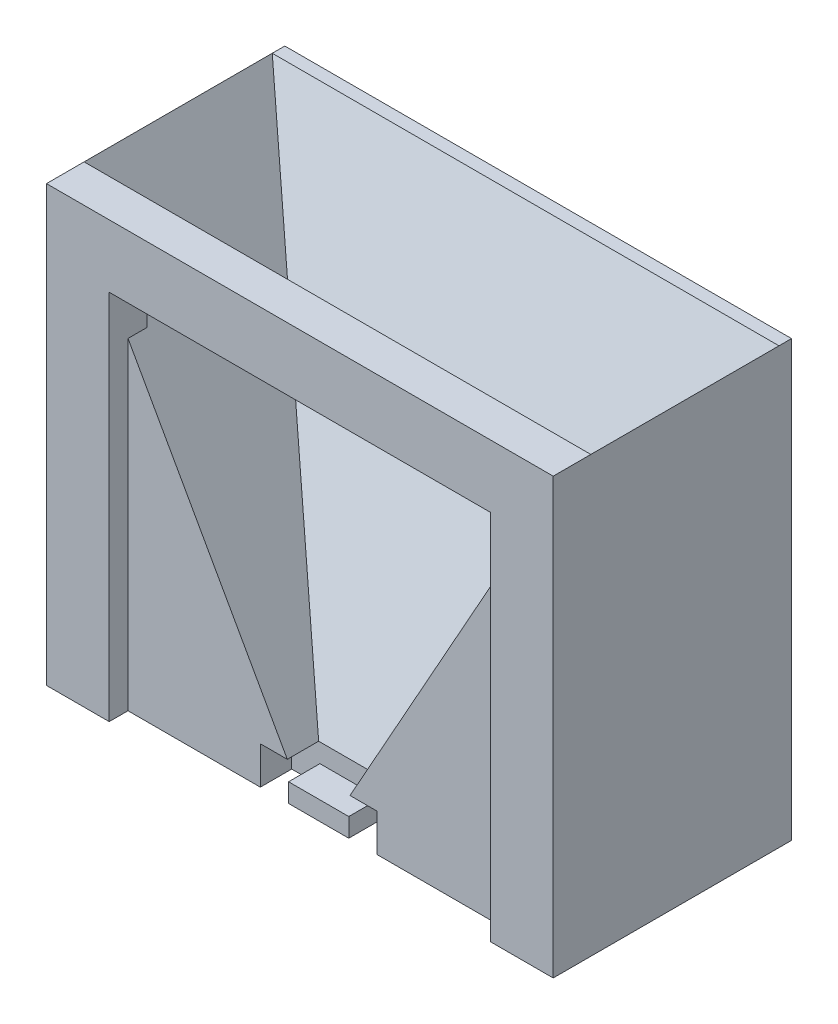
ISO-10303-21;
HEADER;
FILE_DESCRIPTION(('STEP AP214'),'2;1');
FILE_NAME('part.step','',(''),(''),'','','');
FILE_SCHEMA(('AUTOMOTIVE_DESIGN { 1 0 10303 214 1 1 1 1 }'));
ENDSEC;
DATA;
#1=APPLICATION_CONTEXT('core data for automotive mechanical design processes');
#2=APPLICATION_PROTOCOL_DEFINITION('international standard','automotive_design',2000,#1);
#3=PRODUCT_CONTEXT('',#1,'mechanical');
#4=PRODUCT('Part','Part','',(#3));
#5=PRODUCT_RELATED_PRODUCT_CATEGORY('part','',(#4));
#6=PRODUCT_DEFINITION_FORMATION('','',#4);
#7=PRODUCT_DEFINITION_CONTEXT('part definition',#1,'design');
#8=PRODUCT_DEFINITION('design','',#6,#7);
#9=PRODUCT_DEFINITION_SHAPE('','',#8);
#10=(LENGTH_UNIT() NAMED_UNIT(*) SI_UNIT(.MILLI.,.METRE.));
#11=(NAMED_UNIT(*) PLANE_ANGLE_UNIT() SI_UNIT($,.RADIAN.));
#12=(NAMED_UNIT(*) SI_UNIT($,.STERADIAN.) SOLID_ANGLE_UNIT());
#13=UNCERTAINTY_MEASURE_WITH_UNIT(LENGTH_MEASURE(1.E-05),#10,'distance_accuracy_value','');
#14=(GEOMETRIC_REPRESENTATION_CONTEXT(3) GLOBAL_UNCERTAINTY_ASSIGNED_CONTEXT((#13)) GLOBAL_UNIT_ASSIGNED_CONTEXT((#10,
#11,#12)) REPRESENTATION_CONTEXT('',''));
#15=CARTESIAN_POINT('',(0.,0.,0.));
#16=DIRECTION('',(0.,0.,1.));
#17=DIRECTION('',(1.,0.,0.));
#18=AXIS2_PLACEMENT_3D('',#15,#16,#17);
#19=CARTESIAN_POINT('',(0.,0.,0.));
#20=DIRECTION('',(0.,0.,-1.));
#21=DIRECTION('',(-1.,0.,0.));
#22=AXIS2_PLACEMENT_3D('',#19,#20,#21);
#23=PLANE('',#22);
#24=DIRECTION('',(-1.,0.,0.));
#25=VECTOR('',#24,1.);
#26=CARTESIAN_POINT('',(-5.,-24.9,0.));
#27=LINE('',#26,#25);
#28=CARTESIAN_POINT('',(4.8,-24.9,0.));
#29=VERTEX_POINT('',#28);
#30=CARTESIAN_POINT('',(-4.8,-24.9,0.));
#31=VERTEX_POINT('',#30);
#32=EDGE_CURVE('E182',#29,#31,#27,.T.);
#33=ORIENTED_EDGE('',*,*,#32,.T.);
#34=DIRECTION('',(0.,1.,0.));
#35=VECTOR('',#34,1.);
#36=CARTESIAN_POINT('',(-4.8,-21.9,0.));
#37=LINE('',#36,#35);
#38=CARTESIAN_POINT('',(-4.8,-27.9,0.));
#39=VERTEX_POINT('',#38);
#40=EDGE_CURVE('E233',#39,#31,#37,.T.);
#41=ORIENTED_EDGE('',*,*,#40,.F.);
#42=DIRECTION('',(1.,0.,0.));
#43=VECTOR('',#42,1.);
#44=CARTESIAN_POINT('',(40.4,-27.9,0.));
#45=LINE('',#44,#43);
#46=CARTESIAN_POINT('',(4.8,-27.9,0.));
#47=VERTEX_POINT('',#46);
#48=EDGE_CURVE('E202',#39,#47,#45,.T.);
#49=ORIENTED_EDGE('',*,*,#48,.T.);
#50=DIRECTION('',(0.,-1.,0.));
#51=VECTOR('',#50,1.);
#52=CARTESIAN_POINT('',(4.8,-21.9,0.));
#53=LINE('',#52,#51);
#54=EDGE_CURVE('E195',#29,#47,#53,.T.);
#55=ORIENTED_EDGE('',*,*,#54,.F.);
#56=EDGE_LOOP('',(#33,#41,#49,#55));
#57=FACE_BOUND('',#56,.T.);
#58=ADVANCED_FACE('F33',(#57),#23,.F.);
#59=CARTESIAN_POINT('',(-4.8,-21.9,-5.));
#60=DIRECTION('',(1.,0.,0.));
#61=DIRECTION('',(0.,1.,0.));
#62=AXIS2_PLACEMENT_3D('',#59,#60,#61);
#63=PLANE('',#62);
#64=DIRECTION('',(0.,0.,1.));
#65=VECTOR('',#64,1.);
#66=CARTESIAN_POINT('',(-4.8,-24.9,-5.));
#67=LINE('',#66,#65);
#68=CARTESIAN_POINT('',(-4.8,-24.9,-5.));
#69=VERTEX_POINT('',#68);
#70=EDGE_CURVE('E185',#69,#31,#67,.T.);
#71=ORIENTED_EDGE('',*,*,#70,.F.);
#72=DIRECTION('',(0.,1.,0.));
#73=VECTOR('',#72,1.);
#74=CARTESIAN_POINT('',(-4.8,-21.9,-5.));
#75=LINE('',#74,#73);
#76=CARTESIAN_POINT('',(-4.8,-27.9,-5.));
#77=VERTEX_POINT('',#76);
#78=EDGE_CURVE('E223',#77,#69,#75,.T.);
#79=ORIENTED_EDGE('',*,*,#78,.F.);
#80=DIRECTION('',(0.,0.,1.));
#81=VECTOR('',#80,1.);
#82=CARTESIAN_POINT('',(-4.8,-27.9,-5.));
#83=LINE('',#82,#81);
#84=EDGE_CURVE('E232',#77,#39,#83,.T.);
#85=ORIENTED_EDGE('',*,*,#84,.T.);
#86=ORIENTED_EDGE('',*,*,#40,.T.);
#87=EDGE_LOOP('',(#71,#79,#85,#86));
#88=FACE_BOUND('',#87,.T.);
#89=ADVANCED_FACE('F371',(#88),#63,.F.);
#90=CARTESIAN_POINT('',(4.8,-21.9,-5.));
#91=DIRECTION('',(-1.,0.,0.));
#92=DIRECTION('',(0.,-1.,0.));
#93=AXIS2_PLACEMENT_3D('',#90,#91,#92);
#94=PLANE('',#93);
#95=DIRECTION('',(0.,0.,-1.));
#96=VECTOR('',#95,1.);
#97=CARTESIAN_POINT('',(4.8,-24.9,10.2489023802552));
#98=LINE('',#97,#96);
#99=CARTESIAN_POINT('',(4.8,-24.9,-5.));
#100=VERTEX_POINT('',#99);
#101=EDGE_CURVE('E50',#29,#100,#98,.T.);
#102=ORIENTED_EDGE('',*,*,#101,.F.);
#103=ORIENTED_EDGE('',*,*,#54,.T.);
#104=DIRECTION('',(0.,0.,1.));
#105=VECTOR('',#104,1.);
#106=CARTESIAN_POINT('',(4.8,-27.9,-5.));
#107=LINE('',#106,#105);
#108=CARTESIAN_POINT('',(4.8,-27.9,-5.));
#109=VERTEX_POINT('',#108);
#110=EDGE_CURVE('E213',#109,#47,#107,.T.);
#111=ORIENTED_EDGE('',*,*,#110,.F.);
#112=DIRECTION('',(0.,-1.,0.));
#113=VECTOR('',#112,1.);
#114=CARTESIAN_POINT('',(4.8,-21.9,-5.));
#115=LINE('',#114,#113);
#116=EDGE_CURVE('E197',#100,#109,#115,.T.);
#117=ORIENTED_EDGE('',*,*,#116,.F.);
#118=EDGE_LOOP('',(#102,#103,#111,#117));
#119=FACE_BOUND('',#118,.T.);
#120=ADVANCED_FACE('F193',(#119),#94,.F.);
#121=CARTESIAN_POINT('',(-30.4,-27.9,0.));
#122=VERTEX_POINT('',#121);
#123=CARTESIAN_POINT('',(-9.3,-27.9,0.));
#124=VERTEX_POINT('',#123);
#125=EDGE_CURVE('E301',#122,#124,#45,.T.);
#126=ORIENTED_EDGE('',*,*,#125,.T.);
#127=DIRECTION('',(0.,-1.,0.));
#128=VECTOR('',#127,1.);
#129=CARTESIAN_POINT('',(-9.3,-27.9,0.));
#130=LINE('',#129,#128);
#131=CARTESIAN_POINT('',(-9.3,-21.9,0.));
#132=VERTEX_POINT('',#131);
#133=EDGE_CURVE('E224',#132,#124,#130,.T.);
#134=ORIENTED_EDGE('',*,*,#133,.F.);
#135=DIRECTION('',(-1.,0.,0.));
#136=VECTOR('',#135,1.);
#137=CARTESIAN_POINT('',(-9.3,-21.9,0.));
#138=LINE('',#137,#136);
#139=CARTESIAN_POINT('',(-5.,-21.9,0.));
#140=VERTEX_POINT('',#139);
#141=EDGE_CURVE('E235',#140,#132,#138,.T.);
#142=ORIENTED_EDGE('',*,*,#141,.F.);
#143=DIRECTION('',(-0.488099458469831,0.872788014721477,0.));
#144=VECTOR('',#143,1.);
#145=CARTESIAN_POINT('',(-40.4,41.4,0.));
#146=LINE('',#145,#144);
#147=CARTESIAN_POINT('',(-30.4,23.5186440677966,0.));
#148=VERTEX_POINT('',#147);
#149=EDGE_CURVE('E287',#140,#148,#146,.T.);
#150=ORIENTED_EDGE('',*,*,#149,.T.);
#151=DIRECTION('',(0.,1.,0.));
#152=VECTOR('',#151,1.);
#153=CARTESIAN_POINT('',(-30.4,31.4,0.));
#154=LINE('',#153,#152);
#155=EDGE_CURVE('E254',#122,#148,#154,.T.);
#156=ORIENTED_EDGE('',*,*,#155,.F.);
#157=EDGE_LOOP('',(#126,#134,#142,#150,#156));
#158=FACE_BOUND('',#157,.T.);
#159=ADVANCED_FACE('F373',(#158),#23,.F.);
#160=CARTESIAN_POINT('',(40.4,41.4,-35.));
#161=DIRECTION('',(-0.872788014721477,0.488099458469831,0.));
#162=DIRECTION('',(-0.488099458469831,-0.872788014721477,0.));
#163=AXIS2_PLACEMENT_3D('',#160,#161,#162);
#164=PLANE('',#163);
#165=DIRECTION('',(0.455343601054797,0.814216100191205,-0.36015878049532));
#166=VECTOR('',#165,1.);
#167=CARTESIAN_POINT('',(40.7279919921245,41.986494155409,-33.2594286943358));
#168=LINE('',#167,#166);
#169=CARTESIAN_POINT('',(4.99999999999999,-21.9,-5.));
#170=VERTEX_POINT('',#169);
#171=CARTESIAN_POINT('',(40.4,41.4,-33.));
#172=VERTEX_POINT('',#171);
#173=EDGE_CURVE('E58',#170,#172,#168,.T.);
#174=ORIENTED_EDGE('',*,*,#173,.F.);
#175=DIRECTION('',(0.,0.,1.));
#176=VECTOR('',#175,1.);
#177=CARTESIAN_POINT('',(5.,-21.9,-35.));
#178=LINE('',#177,#176);
#179=CARTESIAN_POINT('',(5.,-21.9,0.));
#180=VERTEX_POINT('',#179);
#181=EDGE_CURVE('E306',#170,#180,#178,.T.);
#182=ORIENTED_EDGE('',*,*,#181,.T.);
#183=DIRECTION('',(-0.488099458469831,-0.872788014721477,0.));
#184=VECTOR('',#183,1.);
#185=CARTESIAN_POINT('',(40.4,41.4,0.));
#186=LINE('',#185,#184);
#187=CARTESIAN_POINT('',(30.4,23.5186440677966,0.));
#188=VERTEX_POINT('',#187);
#189=EDGE_CURVE('E292',#188,#180,#186,.T.);
#190=ORIENTED_EDGE('',*,*,#189,.F.);
#191=DIRECTION('',(0.,0.,-1.));
#192=VECTOR('',#191,1.);
#193=CARTESIAN_POINT('',(30.4,23.5186440677966,-3.));
#194=LINE('',#193,#192);
#195=CARTESIAN_POINT('',(30.4,23.5186440677966,-3.));
#196=VERTEX_POINT('',#195);
#197=EDGE_CURVE('E330',#188,#196,#194,.T.);
#198=ORIENTED_EDGE('',*,*,#197,.T.);
#199=DIRECTION('',(0.488099458469831,0.872788014721477,0.));
#200=VECTOR('',#199,1.);
#201=CARTESIAN_POINT('',(13.1383557190521,-7.34751646847463,-3.));
#202=LINE('',#201,#200);
#203=CARTESIAN_POINT('',(40.4,41.4,-3.));
#204=VERTEX_POINT('',#203);
#205=EDGE_CURVE('E327',#196,#204,#202,.T.);
#206=ORIENTED_EDGE('',*,*,#205,.T.);
#207=DIRECTION('',(0.,0.,1.));
#208=VECTOR('',#207,1.);
#209=CARTESIAN_POINT('',(40.4,41.4,-35.));
#210=LINE('',#209,#208);
#211=EDGE_CURVE('E313',#172,#204,#210,.T.);
#212=ORIENTED_EDGE('',*,*,#211,.F.);
#213=EDGE_LOOP('',(#174,#182,#190,#198,#206,#212));
#214=FACE_BOUND('',#213,.T.);
#215=ADVANCED_FACE('F383',(#214),#164,.T.);
#216=CARTESIAN_POINT('',(-40.4,41.4,-35.));
#217=DIRECTION('',(0.872788014721477,0.488099458469831,0.));
#218=DIRECTION('',(-0.488099458469831,0.872788014721477,0.));
#219=AXIS2_PLACEMENT_3D('',#216,#217,#218);
#220=PLANE('',#219);
#221=DIRECTION('',(0.455343601054797,-0.814216100191205,0.36015878049532));
#222=VECTOR('',#221,1.);
#223=CARTESIAN_POINT('',(-40.7279919921245,41.986494155409,-33.2594286943358));
#224=LINE('',#223,#222);
#225=CARTESIAN_POINT('',(-40.4,41.4,-33.));
#226=VERTEX_POINT('',#225);
#227=CARTESIAN_POINT('',(-4.99999999999999,-21.9,-5.));
#228=VERTEX_POINT('',#227);
#229=EDGE_CURVE('E246',#226,#228,#224,.T.);
#230=ORIENTED_EDGE('',*,*,#229,.F.);
#231=DIRECTION('',(0.,0.,1.));
#232=VECTOR('',#231,1.);
#233=CARTESIAN_POINT('',(-40.4,41.4,-35.));
#234=LINE('',#233,#232);
#235=CARTESIAN_POINT('',(-40.4,41.4,-3.));
#236=VERTEX_POINT('',#235);
#237=EDGE_CURVE('E321',#226,#236,#234,.T.);
#238=ORIENTED_EDGE('',*,*,#237,.T.);
#239=DIRECTION('',(0.488099458469831,-0.872788014721477,0.));
#240=VECTOR('',#239,1.);
#241=CARTESIAN_POINT('',(-13.1383557190521,-7.34751646847463,-3.));
#242=LINE('',#241,#240);
#243=CARTESIAN_POINT('',(-30.4,23.5186440677966,-3.));
#244=VERTEX_POINT('',#243);
#245=EDGE_CURVE('E309',#236,#244,#242,.T.);
#246=ORIENTED_EDGE('',*,*,#245,.T.);
#247=DIRECTION('',(0.,0.,1.));
#248=VECTOR('',#247,1.);
#249=CARTESIAN_POINT('',(-30.4,23.5186440677966,-3.));
#250=LINE('',#249,#248);
#251=EDGE_CURVE('E325',#244,#148,#250,.T.);
#252=ORIENTED_EDGE('',*,*,#251,.T.);
#253=ORIENTED_EDGE('',*,*,#149,.F.);
#254=DIRECTION('',(0.,0.,1.));
#255=VECTOR('',#254,1.);
#256=CARTESIAN_POINT('',(-5.,-21.9,-35.));
#257=LINE('',#256,#255);
#258=EDGE_CURVE('E297',#228,#140,#257,.T.);
#259=ORIENTED_EDGE('',*,*,#258,.F.);
#260=EDGE_LOOP('',(#230,#238,#246,#252,#253,#259));
#261=FACE_BOUND('',#260,.T.);
#262=ADVANCED_FACE('F386',(#261),#220,.T.);
#263=ORIENTED_EDGE('',*,*,#189,.T.);
#264=DIRECTION('',(-1.,0.,0.));
#265=VECTOR('',#264,1.);
#266=CARTESIAN_POINT('',(9.3,-21.9,0.));
#267=LINE('',#266,#265);
#268=CARTESIAN_POINT('',(9.3,-21.9,0.));
#269=VERTEX_POINT('',#268);
#270=EDGE_CURVE('E204',#269,#180,#267,.T.);
#271=ORIENTED_EDGE('',*,*,#270,.F.);
#272=DIRECTION('',(0.,1.,0.));
#273=VECTOR('',#272,1.);
#274=CARTESIAN_POINT('',(9.3,-27.9,0.));
#275=LINE('',#274,#273);
#276=CARTESIAN_POINT('',(9.3,-27.9,0.));
#277=VERTEX_POINT('',#276);
#278=EDGE_CURVE('E209',#277,#269,#275,.T.);
#279=ORIENTED_EDGE('',*,*,#278,.F.);
#280=CARTESIAN_POINT('',(30.4,-27.9,0.));
#281=VERTEX_POINT('',#280);
#282=EDGE_CURVE('E300',#277,#281,#45,.T.);
#283=ORIENTED_EDGE('',*,*,#282,.T.);
#284=DIRECTION('',(0.,-1.,0.));
#285=VECTOR('',#284,1.);
#286=CARTESIAN_POINT('',(30.4,31.4,0.));
#287=LINE('',#286,#285);
#288=EDGE_CURVE('E11',#188,#281,#287,.T.);
#289=ORIENTED_EDGE('',*,*,#288,.F.);
#290=EDGE_LOOP('',(#263,#271,#279,#283,#289));
#291=FACE_BOUND('',#290,.T.);
#292=ADVANCED_FACE('F374',(#291),#23,.F.);
#293=CARTESIAN_POINT('',(30.4,-26.4,-3.));
#294=DIRECTION('',(-1.,0.,0.));
#295=DIRECTION('',(0.,0.,1.));
#296=AXIS2_PLACEMENT_3D('',#293,#294,#295);
#297=PLANE('',#296);
#298=ORIENTED_EDGE('',*,*,#197,.F.);
#299=ORIENTED_EDGE('',*,*,#288,.T.);
#300=DIRECTION('',(0.,0.,-1.));
#301=VECTOR('',#300,1.);
#302=CARTESIAN_POINT('',(30.4,-27.9,3.));
#303=LINE('',#302,#301);
#304=CARTESIAN_POINT('',(30.4,-27.9,3.));
#305=VERTEX_POINT('',#304);
#306=EDGE_CURVE('E279',#305,#281,#303,.T.);
#307=ORIENTED_EDGE('',*,*,#306,.F.);
#308=DIRECTION('',(0.,-1.,0.));
#309=VECTOR('',#308,1.);
#310=CARTESIAN_POINT('',(30.4,31.4,3.));
#311=LINE('',#310,#309);
#312=CARTESIAN_POINT('',(30.4,31.4,3.));
#313=VERTEX_POINT('',#312);
#314=EDGE_CURVE('E268',#313,#305,#311,.T.);
#315=ORIENTED_EDGE('',*,*,#314,.F.);
#316=DIRECTION('',(0.,0.,1.));
#317=VECTOR('',#316,1.);
#318=CARTESIAN_POINT('',(30.4,31.4,-3.));
#319=LINE('',#318,#317);
#320=CARTESIAN_POINT('',(30.4,31.4,-3.));
#321=VERTEX_POINT('',#320);
#322=EDGE_CURVE('E42',#321,#313,#319,.T.);
#323=ORIENTED_EDGE('',*,*,#322,.F.);
#324=DIRECTION('',(0.,-1.,0.));
#325=VECTOR('',#324,1.);
#326=CARTESIAN_POINT('',(30.4,-26.4,-3.));
#327=LINE('',#326,#325);
#328=EDGE_CURVE('E332',#321,#196,#327,.T.);
#329=ORIENTED_EDGE('',*,*,#328,.T.);
#330=EDGE_LOOP('',(#298,#299,#307,#315,#323,#329));
#331=FACE_BOUND('',#330,.T.);
#332=ADVANCED_FACE('F35',(#331),#297,.T.);
#333=CARTESIAN_POINT('',(-30.4,31.4,-3.));
#334=DIRECTION('',(0.,-1.,0.));
#335=DIRECTION('',(0.,0.,-1.));
#336=AXIS2_PLACEMENT_3D('',#333,#334,#335);
#337=PLANE('',#336);
#338=ORIENTED_EDGE('',*,*,#322,.T.);
#339=DIRECTION('',(1.,0.,0.));
#340=VECTOR('',#339,1.);
#341=CARTESIAN_POINT('',(30.4,31.4,3.));
#342=LINE('',#341,#340);
#343=CARTESIAN_POINT('',(-30.4,31.4,3.));
#344=VERTEX_POINT('',#343);
#345=EDGE_CURVE('E265',#344,#313,#342,.T.);
#346=ORIENTED_EDGE('',*,*,#345,.F.);
#347=DIRECTION('',(0.,0.,1.));
#348=VECTOR('',#347,1.);
#349=CARTESIAN_POINT('',(-30.4,31.4,-3.));
#350=LINE('',#349,#348);
#351=CARTESIAN_POINT('',(-30.4,31.4,-3.));
#352=VERTEX_POINT('',#351);
#353=EDGE_CURVE('E344',#352,#344,#350,.T.);
#354=ORIENTED_EDGE('',*,*,#353,.F.);
#355=DIRECTION('',(1.,0.,0.));
#356=VECTOR('',#355,1.);
#357=CARTESIAN_POINT('',(-30.4,31.4,-3.));
#358=LINE('',#357,#356);
#359=EDGE_CURVE('E340',#352,#321,#358,.T.);
#360=ORIENTED_EDGE('',*,*,#359,.T.);
#361=EDGE_LOOP('',(#338,#346,#354,#360));
#362=FACE_BOUND('',#361,.T.);
#363=ADVANCED_FACE('F392',(#362),#337,.T.);
#364=CARTESIAN_POINT('',(-30.4,-26.4,-3.));
#365=DIRECTION('',(1.,0.,0.));
#366=DIRECTION('',(0.,0.,-1.));
#367=AXIS2_PLACEMENT_3D('',#364,#365,#366);
#368=PLANE('',#367);
#369=ORIENTED_EDGE('',*,*,#251,.F.);
#370=DIRECTION('',(0.,1.,0.));
#371=VECTOR('',#370,1.);
#372=CARTESIAN_POINT('',(-30.4,-26.4,-3.));
#373=LINE('',#372,#371);
#374=EDGE_CURVE('E338',#244,#352,#373,.T.);
#375=ORIENTED_EDGE('',*,*,#374,.T.);
#376=ORIENTED_EDGE('',*,*,#353,.T.);
#377=DIRECTION('',(0.,1.,0.));
#378=VECTOR('',#377,1.);
#379=CARTESIAN_POINT('',(-30.4,31.4,3.));
#380=LINE('',#379,#378);
#381=CARTESIAN_POINT('',(-30.4,-27.9,3.));
#382=VERTEX_POINT('',#381);
#383=EDGE_CURVE('E262',#382,#344,#380,.T.);
#384=ORIENTED_EDGE('',*,*,#383,.F.);
#385=DIRECTION('',(0.,0.,-1.));
#386=VECTOR('',#385,1.);
#387=CARTESIAN_POINT('',(-30.4,-27.9,3.));
#388=LINE('',#387,#386);
#389=EDGE_CURVE('E284',#382,#122,#388,.T.);
#390=ORIENTED_EDGE('',*,*,#389,.T.);
#391=ORIENTED_EDGE('',*,*,#155,.T.);
#392=EDGE_LOOP('',(#369,#375,#376,#384,#390,#391));
#393=FACE_BOUND('',#392,.T.);
#394=ADVANCED_FACE('F367',(#393),#368,.T.);
#395=CARTESIAN_POINT('',(-40.4,-26.4,-3.));
#396=DIRECTION('',(-1.,0.,0.));
#397=DIRECTION('',(0.,0.,1.));
#398=AXIS2_PLACEMENT_3D('',#395,#396,#397);
#399=PLANE('',#398);
#400=ORIENTED_EDGE('',*,*,#237,.F.);
#401=CARTESIAN_POINT('',(-40.4,41.4,-35.));
#402=VERTEX_POINT('',#401);
#403=EDGE_CURVE('E318',#402,#226,#234,.T.);
#404=ORIENTED_EDGE('',*,*,#403,.F.);
#405=DIRECTION('',(0.,-1.,0.));
#406=VECTOR('',#405,1.);
#407=CARTESIAN_POINT('',(-40.4,-27.9,-35.));
#408=LINE('',#407,#406);
#409=CARTESIAN_POINT('',(-40.4,-27.9,-35.));
#410=VERTEX_POINT('',#409);
#411=EDGE_CURVE('E288',#402,#410,#408,.T.);
#412=ORIENTED_EDGE('',*,*,#411,.T.);
#413=DIRECTION('',(0.,0.,1.));
#414=VECTOR('',#413,1.);
#415=CARTESIAN_POINT('',(-40.4,-27.9,-35.));
#416=LINE('',#415,#414);
#417=CARTESIAN_POINT('',(-40.4,-27.9,3.));
#418=VERTEX_POINT('',#417);
#419=EDGE_CURVE('E316',#410,#418,#416,.T.);
#420=ORIENTED_EDGE('',*,*,#419,.T.);
#421=DIRECTION('',(0.,-1.,0.));
#422=VECTOR('',#421,1.);
#423=CARTESIAN_POINT('',(-40.4,41.4,3.));
#424=LINE('',#423,#422);
#425=CARTESIAN_POINT('',(-40.4,41.4,3.));
#426=VERTEX_POINT('',#425);
#427=EDGE_CURVE('E257',#426,#418,#424,.T.);
#428=ORIENTED_EDGE('',*,*,#427,.F.);
#429=DIRECTION('',(0.,0.,1.));
#430=VECTOR('',#429,1.);
#431=CARTESIAN_POINT('',(-40.4,41.4,-3.));
#432=LINE('',#431,#430);
#433=EDGE_CURVE('E345',#236,#426,#432,.T.);
#434=ORIENTED_EDGE('',*,*,#433,.F.);
#435=EDGE_LOOP('',(#400,#404,#412,#420,#428,#434));
#436=FACE_BOUND('',#435,.T.);
#437=ADVANCED_FACE('F360',(#436),#399,.T.);
#438=CARTESIAN_POINT('',(-40.4,41.4,-3.));
#439=DIRECTION('',(0.,1.,0.));
#440=DIRECTION('',(0.,0.,1.));
#441=AXIS2_PLACEMENT_3D('',#438,#439,#440);
#442=PLANE('',#441);
#443=ORIENTED_EDGE('',*,*,#433,.T.);
#444=DIRECTION('',(-1.,0.,0.));
#445=VECTOR('',#444,1.);
#446=CARTESIAN_POINT('',(-40.4,41.4,3.));
#447=LINE('',#446,#445);
#448=CARTESIAN_POINT('',(40.4,41.4,3.));
#449=VERTEX_POINT('',#448);
#450=EDGE_CURVE('E276',#449,#426,#447,.T.);
#451=ORIENTED_EDGE('',*,*,#450,.F.);
#452=DIRECTION('',(0.,0.,1.));
#453=VECTOR('',#452,1.);
#454=CARTESIAN_POINT('',(40.4,41.4,-3.));
#455=LINE('',#454,#453);
#456=EDGE_CURVE('E37',#204,#449,#455,.T.);
#457=ORIENTED_EDGE('',*,*,#456,.F.);
#458=DIRECTION('',(-1.,0.,0.));
#459=VECTOR('',#458,1.);
#460=CARTESIAN_POINT('',(-40.4,41.4,-3.));
#461=LINE('',#460,#459);
#462=EDGE_CURVE('E335',#204,#236,#461,.T.);
#463=ORIENTED_EDGE('',*,*,#462,.T.);
#464=EDGE_LOOP('',(#443,#451,#457,#463));
#465=FACE_BOUND('',#464,.T.);
#466=ADVANCED_FACE('F358',(#465),#442,.T.);
#467=CARTESIAN_POINT('',(40.4,-26.4,-3.));
#468=DIRECTION('',(1.,0.,0.));
#469=DIRECTION('',(0.,0.,-1.));
#470=AXIS2_PLACEMENT_3D('',#467,#468,#469);
#471=PLANE('',#470);
#472=CARTESIAN_POINT('',(40.4,41.4,-35.));
#473=VERTEX_POINT('',#472);
#474=EDGE_CURVE('E310',#473,#172,#210,.T.);
#475=ORIENTED_EDGE('',*,*,#474,.T.);
#476=ORIENTED_EDGE('',*,*,#211,.T.);
#477=ORIENTED_EDGE('',*,*,#456,.T.);
#478=DIRECTION('',(0.,1.,0.));
#479=VECTOR('',#478,1.);
#480=CARTESIAN_POINT('',(40.4,41.4,3.));
#481=LINE('',#480,#479);
#482=CARTESIAN_POINT('',(40.4,-27.9,3.));
#483=VERTEX_POINT('',#482);
#484=EDGE_CURVE('E273',#483,#449,#481,.T.);
#485=ORIENTED_EDGE('',*,*,#484,.F.);
#486=DIRECTION('',(0.,0.,1.));
#487=VECTOR('',#486,1.);
#488=CARTESIAN_POINT('',(40.4,-27.9,-35.));
#489=LINE('',#488,#487);
#490=CARTESIAN_POINT('',(40.4,-27.9,-35.));
#491=VERTEX_POINT('',#490);
#492=EDGE_CURVE('E314',#491,#483,#489,.T.);
#493=ORIENTED_EDGE('',*,*,#492,.F.);
#494=DIRECTION('',(0.,1.,0.));
#495=VECTOR('',#494,1.);
#496=CARTESIAN_POINT('',(40.4,41.4,-35.));
#497=LINE('',#496,#495);
#498=EDGE_CURVE('E295',#491,#473,#497,.T.);
#499=ORIENTED_EDGE('',*,*,#498,.T.);
#500=EDGE_LOOP('',(#475,#476,#477,#485,#493,#499));
#501=FACE_BOUND('',#500,.T.);
#502=ADVANCED_FACE('F352',(#501),#471,.T.);
#503=CARTESIAN_POINT('',(0.,0.,-3.));
#504=DIRECTION('',(0.,0.,-1.));
#505=DIRECTION('',(-1.,0.,0.));
#506=AXIS2_PLACEMENT_3D('',#503,#504,#505);
#507=PLANE('',#506);
#508=ORIENTED_EDGE('',*,*,#205,.F.);
#509=ORIENTED_EDGE('',*,*,#328,.F.);
#510=ORIENTED_EDGE('',*,*,#359,.F.);
#511=ORIENTED_EDGE('',*,*,#374,.F.);
#512=ORIENTED_EDGE('',*,*,#245,.F.);
#513=ORIENTED_EDGE('',*,*,#462,.F.);
#514=EDGE_LOOP('',(#508,#509,#510,#511,#512,#513));
#515=FACE_BOUND('',#514,.T.);
#516=ADVANCED_FACE('F366',(#515),#507,.T.);
#517=CARTESIAN_POINT('',(40.4,-27.9,-35.));
#518=DIRECTION('',(0.,-1.,0.));
#519=DIRECTION('',(1.,0.,0.));
#520=AXIS2_PLACEMENT_3D('',#517,#518,#519);
#521=PLANE('',#520);
#522=ORIENTED_EDGE('',*,*,#110,.T.);
#523=ORIENTED_EDGE('',*,*,#48,.F.);
#524=ORIENTED_EDGE('',*,*,#84,.F.);
#525=DIRECTION('',(1.,0.,0.));
#526=VECTOR('',#525,1.);
#527=CARTESIAN_POINT('',(-4.8,-27.9,-5.));
#528=LINE('',#527,#526);
#529=CARTESIAN_POINT('',(-9.3,-27.9,-5.));
#530=VERTEX_POINT('',#529);
#531=EDGE_CURVE('E220',#530,#77,#528,.T.);
#532=ORIENTED_EDGE('',*,*,#531,.F.);
#533=DIRECTION('',(0.,0.,1.));
#534=VECTOR('',#533,1.);
#535=CARTESIAN_POINT('',(-9.3,-27.9,-5.));
#536=LINE('',#535,#534);
#537=EDGE_CURVE('E238',#530,#124,#536,.T.);
#538=ORIENTED_EDGE('',*,*,#537,.T.);
#539=ORIENTED_EDGE('',*,*,#125,.F.);
#540=ORIENTED_EDGE('',*,*,#389,.F.);
#541=DIRECTION('',(1.,0.,0.));
#542=VECTOR('',#541,1.);
#543=CARTESIAN_POINT('',(-40.4,-27.9,3.));
#544=LINE('',#543,#542);
#545=EDGE_CURVE('E260',#418,#382,#544,.T.);
#546=ORIENTED_EDGE('',*,*,#545,.F.);
#547=ORIENTED_EDGE('',*,*,#419,.F.);
#548=DIRECTION('',(1.,0.,0.));
#549=VECTOR('',#548,1.);
#550=CARTESIAN_POINT('',(40.4,-27.9,-35.));
#551=LINE('',#550,#549);
#552=EDGE_CURVE('E291',#410,#491,#551,.T.);
#553=ORIENTED_EDGE('',*,*,#552,.T.);
#554=ORIENTED_EDGE('',*,*,#492,.T.);
#555=DIRECTION('',(1.,0.,0.));
#556=VECTOR('',#555,1.);
#557=CARTESIAN_POINT('',(40.4,-27.9,3.));
#558=LINE('',#557,#556);
#559=EDGE_CURVE('E270',#305,#483,#558,.T.);
#560=ORIENTED_EDGE('',*,*,#559,.F.);
#561=ORIENTED_EDGE('',*,*,#306,.T.);
#562=ORIENTED_EDGE('',*,*,#282,.F.);
#563=DIRECTION('',(0.,0.,1.));
#564=VECTOR('',#563,1.);
#565=CARTESIAN_POINT('',(9.3,-27.9,-5.));
#566=LINE('',#565,#564);
#567=CARTESIAN_POINT('',(9.3,-27.9,-5.));
#568=VERTEX_POINT('',#567);
#569=EDGE_CURVE('E218',#568,#277,#566,.T.);
#570=ORIENTED_EDGE('',*,*,#569,.F.);
#571=DIRECTION('',(1.,0.,0.));
#572=VECTOR('',#571,1.);
#573=CARTESIAN_POINT('',(4.8,-27.9,-5.));
#574=LINE('',#573,#572);
#575=EDGE_CURVE('E203',#109,#568,#574,.T.);
#576=ORIENTED_EDGE('',*,*,#575,.F.);
#577=EDGE_LOOP('',(#522,#523,#524,#532,#538,#539,#540,#546,#547,#553,#554,#560,#561,#562,#570,#576));
#578=FACE_BOUND('',#577,.T.);
#579=ADVANCED_FACE('F418',(#578),#521,.T.);
#580=CARTESIAN_POINT('',(0.,0.,-35.));
#581=DIRECTION('',(0.,0.,-1.));
#582=DIRECTION('',(-1.,0.,0.));
#583=AXIS2_PLACEMENT_3D('',#580,#581,#582);
#584=PLANE('',#583);
#585=DIRECTION('',(1.,0.,0.));
#586=VECTOR('',#585,1.);
#587=CARTESIAN_POINT('',(40.4,41.4,-35.));
#588=LINE('',#587,#586);
#589=EDGE_CURVE('E250',#402,#473,#588,.T.);
#590=ORIENTED_EDGE('',*,*,#589,.T.);
#591=ORIENTED_EDGE('',*,*,#498,.F.);
#592=ORIENTED_EDGE('',*,*,#552,.F.);
#593=ORIENTED_EDGE('',*,*,#411,.F.);
#594=EDGE_LOOP('',(#590,#591,#592,#593));
#595=FACE_BOUND('',#594,.T.);
#596=ADVANCED_FACE('F430',(#595),#584,.T.);
#597=CARTESIAN_POINT('',(0.,0.,3.));
#598=DIRECTION('',(0.,0.,1.));
#599=DIRECTION('',(1.,0.,0.));
#600=AXIS2_PLACEMENT_3D('',#597,#598,#599);
#601=PLANE('',#600);
#602=ORIENTED_EDGE('',*,*,#427,.T.);
#603=ORIENTED_EDGE('',*,*,#545,.T.);
#604=ORIENTED_EDGE('',*,*,#383,.T.);
#605=ORIENTED_EDGE('',*,*,#345,.T.);
#606=ORIENTED_EDGE('',*,*,#314,.T.);
#607=ORIENTED_EDGE('',*,*,#559,.T.);
#608=ORIENTED_EDGE('',*,*,#484,.T.);
#609=ORIENTED_EDGE('',*,*,#450,.T.);
#610=EDGE_LOOP('',(#602,#603,#604,#605,#606,#607,#608,#609));
#611=FACE_BOUND('',#610,.T.);
#612=ADVANCED_FACE('F355',(#611),#601,.T.);
#613=CARTESIAN_POINT('',(40.4,41.4,-33.));
#614=DIRECTION('',(0.,1.,0.));
#615=DIRECTION('',(0.,0.,1.));
#616=AXIS2_PLACEMENT_3D('',#613,#614,#615);
#617=PLANE('',#616);
#618=ORIENTED_EDGE('',*,*,#589,.F.);
#619=ORIENTED_EDGE('',*,*,#403,.T.);
#620=DIRECTION('',(1.,0.,0.));
#621=VECTOR('',#620,1.);
#622=CARTESIAN_POINT('',(40.4,41.4,-33.));
#623=LINE('',#622,#621);
#624=EDGE_CURVE('E251',#226,#172,#623,.T.);
#625=ORIENTED_EDGE('',*,*,#624,.T.);
#626=ORIENTED_EDGE('',*,*,#474,.F.);
#627=EDGE_LOOP('',(#618,#619,#625,#626));
#628=FACE_BOUND('',#627,.T.);
#629=ADVANCED_FACE('F434',(#628),#617,.T.);
#630=CARTESIAN_POINT('',(-40.4,-21.9,-5.));
#631=DIRECTION('',(0.,0.404529252154428,0.914525059334833));
#632=DIRECTION('',(0.,-0.914525059334833,0.404529252154428));
#633=AXIS2_PLACEMENT_3D('',#630,#631,#632);
#634=PLANE('',#633);
#635=DIRECTION('',(1.,0.,0.));
#636=VECTOR('',#635,1.);
#637=CARTESIAN_POINT('',(-40.4,-21.9,-5.));
#638=LINE('',#637,#636);
#639=EDGE_CURVE('E215',#228,#170,#638,.T.);
#640=ORIENTED_EDGE('',*,*,#639,.T.);
#641=ORIENTED_EDGE('',*,*,#173,.T.);
#642=ORIENTED_EDGE('',*,*,#624,.F.);
#643=ORIENTED_EDGE('',*,*,#229,.T.);
#644=EDGE_LOOP('',(#640,#641,#642,#643));
#645=FACE_BOUND('',#644,.T.);
#646=ADVANCED_FACE('F435',(#645),#634,.T.);
#647=CARTESIAN_POINT('',(-9.3,-27.9,-5.));
#648=DIRECTION('',(-1.,0.,0.));
#649=DIRECTION('',(0.,0.,1.));
#650=AXIS2_PLACEMENT_3D('',#647,#648,#649);
#651=PLANE('',#650);
#652=ORIENTED_EDGE('',*,*,#133,.T.);
#653=ORIENTED_EDGE('',*,*,#537,.F.);
#654=DIRECTION('',(0.,-1.,0.));
#655=VECTOR('',#654,1.);
#656=CARTESIAN_POINT('',(-9.3,-27.9,-5.));
#657=LINE('',#656,#655);
#658=CARTESIAN_POINT('',(-9.3,-21.9,-5.));
#659=VERTEX_POINT('',#658);
#660=EDGE_CURVE('E229',#659,#530,#657,.T.);
#661=ORIENTED_EDGE('',*,*,#660,.F.);
#662=DIRECTION('',(0.,0.,1.));
#663=VECTOR('',#662,1.);
#664=CARTESIAN_POINT('',(-9.3,-21.9,-5.));
#665=LINE('',#664,#663);
#666=EDGE_CURVE('E241',#659,#132,#665,.T.);
#667=ORIENTED_EDGE('',*,*,#666,.T.);
#668=EDGE_LOOP('',(#652,#653,#661,#667));
#669=FACE_BOUND('',#668,.T.);
#670=ADVANCED_FACE('F461',(#669),#651,.F.);
#671=CARTESIAN_POINT('',(-9.3,-21.9,-5.));
#672=DIRECTION('',(0.,1.,0.));
#673=DIRECTION('',(0.,0.,1.));
#674=AXIS2_PLACEMENT_3D('',#671,#672,#673);
#675=PLANE('',#674);
#676=ORIENTED_EDGE('',*,*,#258,.T.);
#677=ORIENTED_EDGE('',*,*,#141,.T.);
#678=ORIENTED_EDGE('',*,*,#666,.F.);
#679=DIRECTION('',(-1.,0.,0.));
#680=VECTOR('',#679,1.);
#681=CARTESIAN_POINT('',(-9.3,-21.9,-5.));
#682=LINE('',#681,#680);
#683=EDGE_CURVE('E227',#228,#659,#682,.T.);
#684=ORIENTED_EDGE('',*,*,#683,.F.);
#685=EDGE_LOOP('',(#676,#677,#678,#684));
#686=FACE_BOUND('',#685,.T.);
#687=ADVANCED_FACE('F463',(#686),#675,.F.);
#688=CARTESIAN_POINT('',(9.3,-21.9,-5.));
#689=DIRECTION('',(0.,1.,0.));
#690=DIRECTION('',(0.,0.,1.));
#691=AXIS2_PLACEMENT_3D('',#688,#689,#690);
#692=PLANE('',#691);
#693=ORIENTED_EDGE('',*,*,#181,.F.);
#694=DIRECTION('',(-1.,0.,0.));
#695=VECTOR('',#694,1.);
#696=CARTESIAN_POINT('',(9.3,-21.9,-5.));
#697=LINE('',#696,#695);
#698=CARTESIAN_POINT('',(9.3,-21.9,-5.));
#699=VERTEX_POINT('',#698);
#700=EDGE_CURVE('E441',#699,#170,#697,.T.);
#701=ORIENTED_EDGE('',*,*,#700,.F.);
#702=DIRECTION('',(0.,0.,1.));
#703=VECTOR('',#702,1.);
#704=CARTESIAN_POINT('',(9.3,-21.9,-5.));
#705=LINE('',#704,#703);
#706=EDGE_CURVE('E216',#699,#269,#705,.T.);
#707=ORIENTED_EDGE('',*,*,#706,.T.);
#708=ORIENTED_EDGE('',*,*,#270,.T.);
#709=EDGE_LOOP('',(#693,#701,#707,#708));
#710=FACE_BOUND('',#709,.T.);
#711=ADVANCED_FACE('F445',(#710),#692,.F.);
#712=CARTESIAN_POINT('',(9.3,-27.9,-5.));
#713=DIRECTION('',(1.,0.,0.));
#714=DIRECTION('',(0.,0.,-1.));
#715=AXIS2_PLACEMENT_3D('',#712,#713,#714);
#716=PLANE('',#715);
#717=ORIENTED_EDGE('',*,*,#278,.T.);
#718=ORIENTED_EDGE('',*,*,#706,.F.);
#719=DIRECTION('',(0.,1.,0.));
#720=VECTOR('',#719,1.);
#721=CARTESIAN_POINT('',(9.3,-27.9,-5.));
#722=LINE('',#721,#720);
#723=EDGE_CURVE('E207',#568,#699,#722,.T.);
#724=ORIENTED_EDGE('',*,*,#723,.F.);
#725=ORIENTED_EDGE('',*,*,#569,.T.);
#726=EDGE_LOOP('',(#717,#718,#724,#725));
#727=FACE_BOUND('',#726,.T.);
#728=ADVANCED_FACE('F448',(#727),#716,.F.);
#729=CARTESIAN_POINT('',(0.,0.,-5.));
#730=DIRECTION('',(0.,0.,1.));
#731=DIRECTION('',(1.,0.,0.));
#732=AXIS2_PLACEMENT_3D('',#729,#730,#731);
#733=PLANE('',#732);
#734=ORIENTED_EDGE('',*,*,#575,.T.);
#735=ORIENTED_EDGE('',*,*,#723,.T.);
#736=ORIENTED_EDGE('',*,*,#700,.T.);
#737=ORIENTED_EDGE('',*,*,#639,.F.);
#738=ORIENTED_EDGE('',*,*,#683,.T.);
#739=ORIENTED_EDGE('',*,*,#660,.T.);
#740=ORIENTED_EDGE('',*,*,#531,.T.);
#741=ORIENTED_EDGE('',*,*,#78,.T.);
#742=DIRECTION('',(1.,0.,0.));
#743=VECTOR('',#742,1.);
#744=CARTESIAN_POINT('',(-5.,-24.9,-5.));
#745=LINE('',#744,#743);
#746=EDGE_CURVE('E198',#69,#100,#745,.T.);
#747=ORIENTED_EDGE('',*,*,#746,.T.);
#748=ORIENTED_EDGE('',*,*,#116,.T.);
#749=EDGE_LOOP('',(#734,#735,#736,#737,#738,#739,#740,#741,#747,#748));
#750=FACE_BOUND('',#749,.T.);
#751=ADVANCED_FACE('F442',(#750),#733,.T.);
#752=CARTESIAN_POINT('',(-5.,-24.9,10.2489023802552));
#753=DIRECTION('',(0.,1.,0.));
#754=DIRECTION('',(0.,0.,1.));
#755=AXIS2_PLACEMENT_3D('',#752,#753,#754);
#756=PLANE('',#755);
#757=ORIENTED_EDGE('',*,*,#70,.T.);
#758=ORIENTED_EDGE('',*,*,#32,.F.);
#759=ORIENTED_EDGE('',*,*,#101,.T.);
#760=ORIENTED_EDGE('',*,*,#746,.F.);
#761=EDGE_LOOP('',(#757,#758,#759,#760));
#762=FACE_BOUND('',#761,.T.);
#763=ADVANCED_FACE('F183',(#762),#756,.T.);
#764=CLOSED_SHELL('',(#58,#89,#120,#159,#215,#262,#292,#332,#363,#394,#437,#466,#502,#516,#579,
#596,#612,#629,#646,#670,#687,#711,#728,#751,#763));
#765=MANIFOLD_SOLID_BREP('B2',#764);
#766=ADVANCED_BREP_SHAPE_REPRESENTATION('',(#18,#765),#14);
#767=SHAPE_DEFINITION_REPRESENTATION(#9,#766);
ENDSEC;
END-ISO-10303-21;
